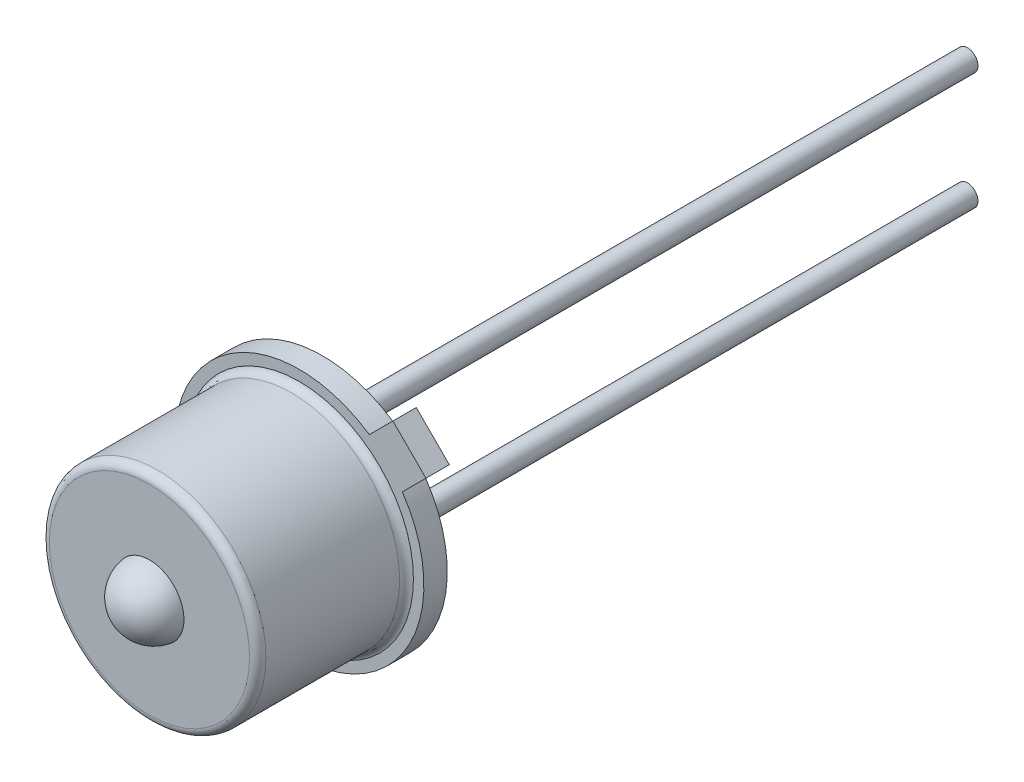
ISO-10303-21;
HEADER;
FILE_DESCRIPTION(('STEP AP214'),'2;1');
FILE_NAME('part.step','',(''),(''),'','','');
FILE_SCHEMA(('AUTOMOTIVE_DESIGN { 1 0 10303 214 1 1 1 1 }'));
ENDSEC;
DATA;
#1=APPLICATION_CONTEXT('core data for automotive mechanical design processes');
#2=APPLICATION_PROTOCOL_DEFINITION('international standard','automotive_design',2000,#1);
#3=PRODUCT_CONTEXT('',#1,'mechanical');
#4=PRODUCT('Part','Part','',(#3));
#5=PRODUCT_RELATED_PRODUCT_CATEGORY('part','',(#4));
#6=PRODUCT_DEFINITION_FORMATION('','',#4);
#7=PRODUCT_DEFINITION_CONTEXT('part definition',#1,'design');
#8=PRODUCT_DEFINITION('design','',#6,#7);
#9=PRODUCT_DEFINITION_SHAPE('','',#8);
#10=(LENGTH_UNIT() NAMED_UNIT(*) SI_UNIT(.MILLI.,.METRE.));
#11=(NAMED_UNIT(*) PLANE_ANGLE_UNIT() SI_UNIT($,.RADIAN.));
#12=(NAMED_UNIT(*) SI_UNIT($,.STERADIAN.) SOLID_ANGLE_UNIT());
#13=UNCERTAINTY_MEASURE_WITH_UNIT(LENGTH_MEASURE(1.E-05),#10,'distance_accuracy_value','');
#14=(GEOMETRIC_REPRESENTATION_CONTEXT(3) GLOBAL_UNCERTAINTY_ASSIGNED_CONTEXT((#13)) GLOBAL_UNIT_ASSIGNED_CONTEXT((#10,
#11,#12)) REPRESENTATION_CONTEXT('',''));
#15=CARTESIAN_POINT('',(0.,0.,0.));
#16=DIRECTION('',(0.,0.,1.));
#17=DIRECTION('',(1.,0.,0.));
#18=AXIS2_PLACEMENT_3D('',#15,#16,#17);
#19=CARTESIAN_POINT('',(0.,0.,3.66431624357357));
#20=DIRECTION('',(0.,0.,-1.));
#21=DIRECTION('',(-1.,0.,0.));
#22=AXIS2_PLACEMENT_3D('',#19,#20,#21);
#23=SPHERICAL_SURFACE('',#22,0.755283653846153);
#24=CARTESIAN_POINT('',(0.,0.,3.75919989741972));
#25=DIRECTION('',(0.,0.,-1.));
#26=DIRECTION('',(-1.,0.,0.));
#27=AXIS2_PLACEMENT_3D('',#24,#25,#26);
#28=CIRCLE('',#27,0.7493);
#29=CARTESIAN_POINT('',(-0.7493,0.,3.75919989741972));
#30=VERTEX_POINT('',#29);
#31=EDGE_CURVE('E13',#30,#30,#28,.T.);
#32=ORIENTED_EDGE('',*,*,#31,.F.);
#33=EDGE_LOOP('',(#32));
#34=FACE_BOUND('',#33,.T.);
#35=ADVANCED_FACE('F55',(#34),#23,.T.);
#36=CARTESIAN_POINT('',(-0.543868966826498,0.,3.75919989741972));
#37=DIRECTION('',(0.,0.,-1.));
#38=DIRECTION('',(-1.,0.,0.));
#39=AXIS2_PLACEMENT_3D('',#36,#37,#38);
#40=PLANE('',#39);
#41=ORIENTED_EDGE('',*,*,#31,.T.);
#42=EDGE_LOOP('',(#41));
#43=FACE_BOUND('',#42,.T.);
#44=CARTESIAN_POINT('',(0.,0.,3.75919989741972));
#45=DIRECTION('',(0.,0.,-1.));
#46=DIRECTION('',(-1.,0.,0.));
#47=AXIS2_PLACEMENT_3D('',#44,#45,#46);
#48=CIRCLE('',#47,0.543868966826498);
#49=CARTESIAN_POINT('',(-0.543868966826498,0.,3.75919989741972));
#50=VERTEX_POINT('',#49);
#51=EDGE_CURVE('E61',#50,#50,#48,.T.);
#52=ORIENTED_EDGE('',*,*,#51,.F.);
#53=EDGE_LOOP('',(#52));
#54=FACE_BOUND('',#53,.T.);
#55=ADVANCED_FACE('F69',(#43,#54),#40,.T.);
#56=CARTESIAN_POINT('',(0.,0.,3.66431624357357));
#57=DIRECTION('',(0.,0.,-1.));
#58=DIRECTION('',(1.,0.,0.));
#59=AXIS2_PLACEMENT_3D('',#56,#57,#58);
#60=SPHERICAL_SURFACE('',#59,0.552083653846153);
#61=ORIENTED_EDGE('',*,*,#51,.T.);
#62=EDGE_LOOP('',(#61));
#63=FACE_BOUND('',#62,.T.);
#64=ADVANCED_FACE('F67',(#63),#60,.F.);
#65=CLOSED_SHELL('',(#35,#55,#64));
#66=MANIFOLD_SOLID_BREP('B2',#65);
#67=CARTESIAN_POINT('',(0.,0.,0.));
#68=DIRECTION('',(0.,0.,1.));
#69=DIRECTION('',(1.,0.,0.));
#70=AXIS2_PLACEMENT_3D('',#67,#68,#69);
#71=PLANE('',#70);
#72=CARTESIAN_POINT('',(0.,1.27,0.));
#73=DIRECTION('',(0.,0.,1.));
#74=DIRECTION('',(1.,0.,0.));
#75=AXIS2_PLACEMENT_3D('',#72,#73,#74);
#76=CIRCLE('',#75,0.2286);
#77=CARTESIAN_POINT('',(0.228600000000003,1.27,0.));
#78=VERTEX_POINT('',#77);
#79=EDGE_CURVE('E112',#78,#78,#76,.F.);
#80=ORIENTED_EDGE('',*,*,#79,.F.);
#81=EDGE_LOOP('',(#80));
#82=FACE_BOUND('',#81,.T.);
#83=CARTESIAN_POINT('',(0.,-1.27,0.));
#84=DIRECTION('',(0.,0.,1.));
#85=DIRECTION('',(1.,0.,0.));
#86=AXIS2_PLACEMENT_3D('',#83,#84,#85);
#87=CIRCLE('',#86,0.2286);
#88=CARTESIAN_POINT('',(0.2286,-1.27,0.));
#89=VERTEX_POINT('',#88);
#90=EDGE_CURVE('E187',#89,#89,#87,.F.);
#91=ORIENTED_EDGE('',*,*,#90,.F.);
#92=EDGE_LOOP('',(#91));
#93=FACE_BOUND('',#92,.T.);
#94=DIRECTION('',(0.707106781186548,0.707106781186547,0.));
#95=VECTOR('',#94,1.);
#96=CARTESIAN_POINT('',(2.74964666119792,2.0323397232714,0.));
#97=LINE('',#96,#95);
#98=CARTESIAN_POINT('',(2.23752299455588,1.52021605662936,0.));
#99=VERTEX_POINT('',#98);
#100=CARTESIAN_POINT('',(2.74964666119792,2.0323397232714,0.));
#101=VERTEX_POINT('',#100);
#102=EDGE_CURVE('E171',#99,#101,#97,.T.);
#103=ORIENTED_EDGE('',*,*,#102,.F.);
#104=CARTESIAN_POINT('',(0.,0.,0.));
#105=DIRECTION('',(0.,0.,1.));
#106=DIRECTION('',(1.,0.,0.));
#107=AXIS2_PLACEMENT_3D('',#104,#105,#106);
#108=CIRCLE('',#107,2.7051);
#109=CARTESIAN_POINT('',(1.52021605662936,2.23752299455588,0.));
#110=VERTEX_POINT('',#109);
#111=EDGE_CURVE('E143',#110,#99,#108,.T.);
#112=ORIENTED_EDGE('',*,*,#111,.F.);
#113=DIRECTION('',(-0.707106781186548,-0.707106781186548,0.));
#114=VECTOR('',#113,1.);
#115=CARTESIAN_POINT('',(2.0323397232714,2.74964666119792,0.));
#116=LINE('',#115,#114);
#117=CARTESIAN_POINT('',(2.0323397232714,2.74964666119792,0.));
#118=VERTEX_POINT('',#117);
#119=EDGE_CURVE('E137',#118,#110,#116,.T.);
#120=ORIENTED_EDGE('',*,*,#119,.F.);
#121=DIRECTION('',(-0.707106781186547,0.707106781186547,0.));
#122=VECTOR('',#121,1.);
#123=CARTESIAN_POINT('',(2.74964666119792,2.0323397232714,0.));
#124=LINE('',#123,#122);
#125=EDGE_CURVE('E161',#101,#118,#124,.T.);
#126=ORIENTED_EDGE('',*,*,#125,.F.);
#127=EDGE_LOOP('',(#103,#112,#120,#126));
#128=FACE_BOUND('',#127,.T.);
#129=CARTESIAN_POINT('',(-1.2645505667785,0.,0.));
#130=DIRECTION('',(0.,0.,1.));
#131=DIRECTION('',(1.,0.,0.));
#132=AXIS2_PLACEMENT_3D('',#129,#130,#131);
#133=CIRCLE('',#132,0.5072126);
#134=CARTESIAN_POINT('',(-0.757337966778502,0.,0.));
#135=VERTEX_POINT('',#134);
#136=EDGE_CURVE('E53',#135,#135,#133,.F.);
#137=ORIENTED_EDGE('',*,*,#136,.F.);
#138=EDGE_LOOP('',(#137));
#139=FACE_BOUND('',#138,.T.);
#140=ADVANCED_FACE('F103',(#82,#93,#128,#139),#71,.F.);
#141=CARTESIAN_POINT('',(2.74964666119792,2.0323397232714,0.5072126));
#142=DIRECTION('',(-0.707106781186547,0.707106781186548,0.));
#143=DIRECTION('',(-0.707106781186548,-0.707106781186547,0.));
#144=AXIS2_PLACEMENT_3D('',#141,#142,#143);
#145=PLANE('',#144);
#146=ORIENTED_EDGE('',*,*,#102,.T.);
#147=DIRECTION('',(0.,0.,-1.));
#148=VECTOR('',#147,1.);
#149=CARTESIAN_POINT('',(2.74964666119792,2.0323397232714,0.5072126));
#150=LINE('',#149,#148);
#151=CARTESIAN_POINT('',(2.74964666119792,2.0323397232714,0.5072126));
#152=VERTEX_POINT('',#151);
#153=EDGE_CURVE('E162',#152,#101,#150,.T.);
#154=ORIENTED_EDGE('',*,*,#153,.F.);
#155=DIRECTION('',(0.707106781186548,0.707106781186547,0.));
#156=VECTOR('',#155,1.);
#157=CARTESIAN_POINT('',(2.74964666119792,2.0323397232714,0.5072126));
#158=LINE('',#157,#156);
#159=CARTESIAN_POINT('',(2.23752299455588,1.52021605662936,0.5072126));
#160=VERTEX_POINT('',#159);
#161=EDGE_CURVE('E156',#160,#152,#158,.T.);
#162=ORIENTED_EDGE('',*,*,#161,.F.);
#163=DIRECTION('',(0.,0.,-1.));
#164=VECTOR('',#163,1.);
#165=CARTESIAN_POINT('',(2.23752299455588,1.52021605662936,0.5072126));
#166=LINE('',#165,#164);
#167=EDGE_CURVE('E167',#160,#99,#166,.T.);
#168=ORIENTED_EDGE('',*,*,#167,.T.);
#169=EDGE_LOOP('',(#146,#154,#162,#168));
#170=FACE_BOUND('',#169,.T.);
#171=ADVANCED_FACE('F105',(#170),#145,.F.);
#172=CARTESIAN_POINT('',(2.74964666119792,2.0323397232714,0.5072126));
#173=DIRECTION('',(-0.707106781186548,-0.707106781186548,0.));
#174=DIRECTION('',(0.707106781186548,-0.707106781186548,0.));
#175=AXIS2_PLACEMENT_3D('',#172,#173,#174);
#176=PLANE('',#175);
#177=ORIENTED_EDGE('',*,*,#125,.T.);
#178=DIRECTION('',(0.,0.,-1.));
#179=VECTOR('',#178,1.);
#180=CARTESIAN_POINT('',(2.0323397232714,2.74964666119792,0.5072126));
#181=LINE('',#180,#179);
#182=CARTESIAN_POINT('',(2.0323397232714,2.74964666119792,0.5072126));
#183=VERTEX_POINT('',#182);
#184=EDGE_CURVE('E159',#183,#118,#181,.T.);
#185=ORIENTED_EDGE('',*,*,#184,.F.);
#186=DIRECTION('',(-0.707106781186547,0.707106781186547,0.));
#187=VECTOR('',#186,1.);
#188=CARTESIAN_POINT('',(2.74964666119792,2.0323397232714,0.5072126));
#189=LINE('',#188,#187);
#190=EDGE_CURVE('E151',#152,#183,#189,.T.);
#191=ORIENTED_EDGE('',*,*,#190,.F.);
#192=ORIENTED_EDGE('',*,*,#153,.T.);
#193=EDGE_LOOP('',(#177,#185,#191,#192));
#194=FACE_BOUND('',#193,.T.);
#195=ADVANCED_FACE('F160',(#194),#176,.F.);
#196=CARTESIAN_POINT('',(2.0323397232714,2.74964666119792,0.5072126));
#197=DIRECTION('',(0.707106781186548,-0.707106781186548,0.));
#198=DIRECTION('',(0.707106781186548,0.707106781186548,0.));
#199=AXIS2_PLACEMENT_3D('',#196,#197,#198);
#200=PLANE('',#199);
#201=ORIENTED_EDGE('',*,*,#119,.T.);
#202=DIRECTION('',(0.,0.,-1.));
#203=VECTOR('',#202,1.);
#204=CARTESIAN_POINT('',(1.52021605662936,2.23752299455588,0.5072126));
#205=LINE('',#204,#203);
#206=CARTESIAN_POINT('',(1.52021605662936,2.23752299455588,0.5072126));
#207=VERTEX_POINT('',#206);
#208=EDGE_CURVE('E163',#207,#110,#205,.T.);
#209=ORIENTED_EDGE('',*,*,#208,.F.);
#210=DIRECTION('',(-0.707106781186548,-0.707106781186548,0.));
#211=VECTOR('',#210,1.);
#212=CARTESIAN_POINT('',(2.0323397232714,2.74964666119792,0.5072126));
#213=LINE('',#212,#211);
#214=EDGE_CURVE('E154',#183,#207,#213,.T.);
#215=ORIENTED_EDGE('',*,*,#214,.F.);
#216=ORIENTED_EDGE('',*,*,#184,.T.);
#217=EDGE_LOOP('',(#201,#209,#215,#216));
#218=FACE_BOUND('',#217,.T.);
#219=ADVANCED_FACE('F165',(#218),#200,.F.);
#220=CARTESIAN_POINT('',(0.,0.,0.5072126));
#221=DIRECTION('',(0.,0.,-1.));
#222=DIRECTION('',(-1.,0.,0.));
#223=AXIS2_PLACEMENT_3D('',#220,#221,#222);
#224=CYLINDRICAL_SURFACE('',#223,2.7051);
#225=ORIENTED_EDGE('',*,*,#111,.T.);
#226=ORIENTED_EDGE('',*,*,#167,.F.);
#227=CARTESIAN_POINT('',(0.,0.,0.5072126));
#228=DIRECTION('',(0.,0.,1.));
#229=DIRECTION('',(1.,0.,0.));
#230=AXIS2_PLACEMENT_3D('',#227,#228,#229);
#231=CIRCLE('',#230,2.7051);
#232=EDGE_CURVE('E120',#207,#160,#231,.T.);
#233=ORIENTED_EDGE('',*,*,#232,.F.);
#234=ORIENTED_EDGE('',*,*,#208,.T.);
#235=EDGE_LOOP('',(#225,#226,#233,#234));
#236=FACE_BOUND('',#235,.T.);
#237=ADVANCED_FACE('F241',(#236),#224,.T.);
#238=CARTESIAN_POINT('',(0.,0.,0.5072126));
#239=DIRECTION('',(0.,0.,1.));
#240=DIRECTION('',(1.,0.,0.));
#241=AXIS2_PLACEMENT_3D('',#238,#239,#240);
#242=PLANE('',#241);
#243=CARTESIAN_POINT('',(0.,0.,0.5072126));
#244=DIRECTION('',(0.,0.,-1.));
#245=DIRECTION('',(-1.,0.,0.));
#246=AXIS2_PLACEMENT_3D('',#243,#244,#245);
#247=CIRCLE('',#246,2.47764353480867);
#248=CARTESIAN_POINT('',(-2.47764353480867,0.,0.5072126));
#249=VERTEX_POINT('',#248);
#250=EDGE_CURVE('E181',#249,#249,#247,.F.);
#251=ORIENTED_EDGE('',*,*,#250,.F.);
#252=EDGE_LOOP('',(#251));
#253=FACE_BOUND('',#252,.T.);
#254=ORIENTED_EDGE('',*,*,#161,.T.);
#255=ORIENTED_EDGE('',*,*,#190,.T.);
#256=ORIENTED_EDGE('',*,*,#214,.T.);
#257=ORIENTED_EDGE('',*,*,#232,.T.);
#258=EDGE_LOOP('',(#254,#255,#256,#257));
#259=FACE_BOUND('',#258,.T.);
#260=ADVANCED_FACE('F152',(#253,#259),#242,.T.);
#261=CARTESIAN_POINT('',(0.,0.,0.5072126));
#262=DIRECTION('',(0.,0.,-1.));
#263=DIRECTION('',(-1.,0.,0.));
#264=AXIS2_PLACEMENT_3D('',#261,#262,#263);
#265=CYLINDRICAL_SURFACE('',#264,2.1971);
#266=CARTESIAN_POINT('',(0.,0.,0.5072126));
#267=DIRECTION('',(0.,0.,1.));
#268=DIRECTION('',(1.,0.,0.));
#269=AXIS2_PLACEMENT_3D('',#266,#267,#268);
#270=CIRCLE('',#269,2.1971);
#271=CARTESIAN_POINT('',(2.1971,0.,0.5072126));
#272=VERTEX_POINT('',#271);
#273=EDGE_CURVE('E184',#272,#272,#270,.F.);
#274=ORIENTED_EDGE('',*,*,#273,.T.);
#275=EDGE_LOOP('',(#274));
#276=FACE_BOUND('',#275,.T.);
#277=CARTESIAN_POINT('',(0.,0.,3.60679989741972));
#278=DIRECTION('',(0.,0.,-1.));
#279=DIRECTION('',(-1.,0.,0.));
#280=AXIS2_PLACEMENT_3D('',#277,#278,#279);
#281=CIRCLE('',#280,2.1971);
#282=CARTESIAN_POINT('',(-2.1971,0.,3.60679989741972));
#283=VERTEX_POINT('',#282);
#284=EDGE_CURVE('E174',#283,#283,#281,.T.);
#285=ORIENTED_EDGE('',*,*,#284,.F.);
#286=EDGE_LOOP('',(#285));
#287=FACE_BOUND('',#286,.T.);
#288=ADVANCED_FACE('F231',(#276,#287),#265,.F.);
#289=CARTESIAN_POINT('',(0.,0.7493,3.60679989741972));
#290=DIRECTION('',(0.,0.,-1.));
#291=DIRECTION('',(-1.,0.,0.));
#292=AXIS2_PLACEMENT_3D('',#289,#290,#291);
#293=PLANE('',#292);
#294=ORIENTED_EDGE('',*,*,#284,.T.);
#295=EDGE_LOOP('',(#294));
#296=FACE_BOUND('',#295,.T.);
#297=CARTESIAN_POINT('',(0.,0.,3.60679989741972));
#298=DIRECTION('',(0.,0.,-1.));
#299=DIRECTION('',(-1.,0.,0.));
#300=AXIS2_PLACEMENT_3D('',#297,#298,#299);
#301=CIRCLE('',#300,0.7493);
#302=CARTESIAN_POINT('',(-0.7493,0.,3.60679989741972));
#303=VERTEX_POINT('',#302);
#304=EDGE_CURVE('E222',#303,#303,#301,.T.);
#305=ORIENTED_EDGE('',*,*,#304,.F.);
#306=EDGE_LOOP('',(#305));
#307=FACE_BOUND('',#306,.T.);
#308=ADVANCED_FACE('F228',(#296,#307),#293,.T.);
#309=CARTESIAN_POINT('',(0.,0.,0.5072126));
#310=DIRECTION('',(0.,0.,-1.));
#311=DIRECTION('',(-1.,0.,0.));
#312=AXIS2_PLACEMENT_3D('',#309,#310,#311);
#313=CYLINDRICAL_SURFACE('',#312,0.7493);
#314=ORIENTED_EDGE('',*,*,#304,.T.);
#315=EDGE_LOOP('',(#314));
#316=FACE_BOUND('',#315,.T.);
#317=CARTESIAN_POINT('',(0.,0.,3.75919989741972));
#318=DIRECTION('',(0.,0.,-1.));
#319=DIRECTION('',(-1.,0.,0.));
#320=AXIS2_PLACEMENT_3D('',#317,#318,#319);
#321=CIRCLE('',#320,0.7493);
#322=CARTESIAN_POINT('',(-0.7493,0.,3.75919989741972));
#323=VERTEX_POINT('',#322);
#324=EDGE_CURVE('E219',#323,#323,#321,.T.);
#325=ORIENTED_EDGE('',*,*,#324,.F.);
#326=EDGE_LOOP('',(#325));
#327=FACE_BOUND('',#326,.T.);
#328=ADVANCED_FACE('F239',(#316,#327),#313,.F.);
#329=CARTESIAN_POINT('',(0.,0.7493,3.75919989741972));
#330=DIRECTION('',(0.,0.,1.));
#331=DIRECTION('',(1.,0.,0.));
#332=AXIS2_PLACEMENT_3D('',#329,#330,#331);
#333=PLANE('',#332);
#334=ORIENTED_EDGE('',*,*,#324,.T.);
#335=EDGE_LOOP('',(#334));
#336=FACE_BOUND('',#335,.T.);
#337=CARTESIAN_POINT('',(0.,0.,3.75919989741972));
#338=DIRECTION('',(0.,0.,-1.));
#339=DIRECTION('',(-1.,0.,0.));
#340=AXIS2_PLACEMENT_3D('',#337,#338,#339);
#341=CIRCLE('',#340,2.1717);
#342=CARTESIAN_POINT('',(-2.1717,0.,3.75919989741972));
#343=VERTEX_POINT('',#342);
#344=EDGE_CURVE('E216',#343,#343,#341,.T.);
#345=ORIENTED_EDGE('',*,*,#344,.F.);
#346=EDGE_LOOP('',(#345));
#347=FACE_BOUND('',#346,.T.);
#348=ADVANCED_FACE('F298',(#336,#347),#333,.T.);
#349=CARTESIAN_POINT('',(0.,0.,3.58139989741972));
#350=DIRECTION('',(0.,0.,-1.));
#351=DIRECTION('',(-1.,0.,0.));
#352=AXIS2_PLACEMENT_3D('',#349,#350,#351);
#353=TOROIDAL_SURFACE('',#352,2.1717,0.1778);
#354=ORIENTED_EDGE('',*,*,#344,.T.);
#355=EDGE_LOOP('',(#354));
#356=FACE_BOUND('',#355,.T.);
#357=CARTESIAN_POINT('',(0.,0.,3.58139989741972));
#358=DIRECTION('',(0.,0.,-1.));
#359=DIRECTION('',(-1.,0.,0.));
#360=AXIS2_PLACEMENT_3D('',#357,#358,#359);
#361=CIRCLE('',#360,2.3495);
#362=CARTESIAN_POINT('',(-2.3495,0.,3.58139989741972));
#363=VERTEX_POINT('',#362);
#364=EDGE_CURVE('E213',#363,#363,#361,.T.);
#365=ORIENTED_EDGE('',*,*,#364,.F.);
#366=EDGE_LOOP('',(#365));
#367=FACE_BOUND('',#366,.T.);
#368=ADVANCED_FACE('F309',(#356,#367),#353,.T.);
#369=CARTESIAN_POINT('',(0.,0.,0.5072126));
#370=DIRECTION('',(0.,0.,-1.));
#371=DIRECTION('',(-1.,0.,0.));
#372=AXIS2_PLACEMENT_3D('',#369,#370,#371);
#373=CYLINDRICAL_SURFACE('',#372,2.3495);
#374=ORIENTED_EDGE('',*,*,#364,.T.);
#375=EDGE_LOOP('',(#374));
#376=FACE_BOUND('',#375,.T.);
#377=CARTESIAN_POINT('',(0.,0.,0.677937745964801));
#378=DIRECTION('',(0.,0.,-1.));
#379=DIRECTION('',(-1.,0.,0.));
#380=AXIS2_PLACEMENT_3D('',#377,#378,#379);
#381=CIRCLE('',#380,2.3495);
#382=CARTESIAN_POINT('',(-2.3495,0.,0.677937745964801));
#383=VERTEX_POINT('',#382);
#384=EDGE_CURVE('E210',#383,#383,#381,.T.);
#385=ORIENTED_EDGE('',*,*,#384,.F.);
#386=EDGE_LOOP('',(#385));
#387=FACE_BOUND('',#386,.T.);
#388=ADVANCED_FACE('F321',(#376,#387),#373,.T.);
#389=CARTESIAN_POINT('',(0.,0.,0.677937745964801));
#390=DIRECTION('',(0.,0.,-1.));
#391=DIRECTION('',(-1.,0.,0.));
#392=AXIS2_PLACEMENT_3D('',#389,#390,#391);
#393=TOROIDAL_SURFACE('',#392,2.5273,0.1778);
#394=ORIENTED_EDGE('',*,*,#384,.T.);
#395=EDGE_LOOP('',(#394));
#396=FACE_BOUND('',#395,.T.);
#397=ORIENTED_EDGE('',*,*,#250,.T.);
#398=EDGE_LOOP('',(#397));
#399=FACE_BOUND('',#398,.T.);
#400=ADVANCED_FACE('F332',(#396,#399),#393,.F.);
#401=ORIENTED_EDGE('',*,*,#273,.F.);
#402=EDGE_LOOP('',(#401));
#403=FACE_BOUND('',#402,.T.);
#404=ADVANCED_FACE('F244',(#403),#242,.T.);
#405=CARTESIAN_POINT('',(0.,-1.27,-13.9954));
#406=DIRECTION('',(0.,0.,1.));
#407=DIRECTION('',(1.,0.,0.));
#408=AXIS2_PLACEMENT_3D('',#405,#406,#407);
#409=CYLINDRICAL_SURFACE('',#408,0.2286);
#410=CARTESIAN_POINT('',(0.,-1.27,-13.9954));
#411=DIRECTION('',(0.,0.,-1.));
#412=DIRECTION('',(-1.,0.,0.));
#413=AXIS2_PLACEMENT_3D('',#410,#411,#412);
#414=CIRCLE('',#413,0.2286);
#415=CARTESIAN_POINT('',(-0.2286,-1.27,-13.9954));
#416=VERTEX_POINT('',#415);
#417=EDGE_CURVE('E207',#416,#416,#414,.T.);
#418=ORIENTED_EDGE('',*,*,#417,.F.);
#419=EDGE_LOOP('',(#418));
#420=FACE_BOUND('',#419,.T.);
#421=ORIENTED_EDGE('',*,*,#90,.T.);
#422=EDGE_LOOP('',(#421));
#423=FACE_BOUND('',#422,.T.);
#424=ADVANCED_FACE('F352',(#420,#423),#409,.T.);
#425=CARTESIAN_POINT('',(0.,-1.27,-13.9954));
#426=DIRECTION('',(0.,0.,-1.));
#427=DIRECTION('',(-1.,0.,0.));
#428=AXIS2_PLACEMENT_3D('',#425,#426,#427);
#429=PLANE('',#428);
#430=ORIENTED_EDGE('',*,*,#417,.T.);
#431=EDGE_LOOP('',(#430));
#432=FACE_BOUND('',#431,.T.);
#433=ADVANCED_FACE('F360',(#432),#429,.T.);
#434=CARTESIAN_POINT('',(0.,1.27,-13.9954));
#435=DIRECTION('',(0.,0.,1.));
#436=DIRECTION('',(1.,0.,0.));
#437=AXIS2_PLACEMENT_3D('',#434,#435,#436);
#438=CYLINDRICAL_SURFACE('',#437,0.2286);
#439=CARTESIAN_POINT('',(0.,1.27,-13.9954));
#440=DIRECTION('',(0.,0.,-1.));
#441=DIRECTION('',(1.,0.,0.));
#442=AXIS2_PLACEMENT_3D('',#439,#440,#441);
#443=CIRCLE('',#442,0.2286);
#444=CARTESIAN_POINT('',(0.228600000000003,1.27,-13.9954));
#445=VERTEX_POINT('',#444);
#446=EDGE_CURVE('E193',#445,#445,#443,.T.);
#447=ORIENTED_EDGE('',*,*,#446,.F.);
#448=EDGE_LOOP('',(#447));
#449=FACE_BOUND('',#448,.T.);
#450=ORIENTED_EDGE('',*,*,#79,.T.);
#451=EDGE_LOOP('',(#450));
#452=FACE_BOUND('',#451,.T.);
#453=ADVANCED_FACE('F371',(#449,#452),#438,.T.);
#454=CARTESIAN_POINT('',(0.,1.27,-13.9954));
#455=DIRECTION('',(0.,0.,1.));
#456=DIRECTION('',(1.,0.,0.));
#457=AXIS2_PLACEMENT_3D('',#454,#455,#456);
#458=PLANE('',#457);
#459=ORIENTED_EDGE('',*,*,#446,.T.);
#460=EDGE_LOOP('',(#459));
#461=FACE_BOUND('',#460,.T.);
#462=ADVANCED_FACE('F397',(#461),#458,.F.);
#463=CARTESIAN_POINT('',(-1.2645505667785,0.,-0.3381502));
#464=DIRECTION('',(0.,0.,-1.));
#465=DIRECTION('',(-1.,0.,0.));
#466=AXIS2_PLACEMENT_3D('',#463,#464,#465);
#467=PLANE('',#466);
#468=CARTESIAN_POINT('',(-1.2645505667785,0.,-0.3381502));
#469=DIRECTION('',(0.,0.,-1.));
#470=DIRECTION('',(-1.,0.,0.));
#471=AXIS2_PLACEMENT_3D('',#468,#469,#470);
#472=CIRCLE('',#471,0.5072126);
#473=CARTESIAN_POINT('',(-1.7717631667785,0.,-0.3381502));
#474=VERTEX_POINT('',#473);
#475=EDGE_CURVE('E194',#474,#474,#472,.T.);
#476=ORIENTED_EDGE('',*,*,#475,.T.);
#477=EDGE_LOOP('',(#476));
#478=FACE_BOUND('',#477,.T.);
#479=CARTESIAN_POINT('',(-1.27,0.,-0.3381502));
#480=DIRECTION('',(0.,0.,-1.));
#481=DIRECTION('',(-1.,0.,0.));
#482=AXIS2_PLACEMENT_3D('',#479,#480,#481);
#483=CIRCLE('',#482,0.2286);
#484=CARTESIAN_POINT('',(-1.4986,0.,-0.3381502));
#485=VERTEX_POINT('',#484);
#486=EDGE_CURVE('E191',#485,#485,#483,.T.);
#487=ORIENTED_EDGE('',*,*,#486,.F.);
#488=EDGE_LOOP('',(#487));
#489=FACE_BOUND('',#488,.T.);
#490=ADVANCED_FACE('F408',(#478,#489),#467,.T.);
#491=CARTESIAN_POINT('',(-1.2645505667785,0.,-0.3381502));
#492=DIRECTION('',(0.,0.,1.));
#493=DIRECTION('',(1.,0.,0.));
#494=AXIS2_PLACEMENT_3D('',#491,#492,#493);
#495=CYLINDRICAL_SURFACE('',#494,0.5072126);
#496=ORIENTED_EDGE('',*,*,#475,.F.);
#497=EDGE_LOOP('',(#496));
#498=FACE_BOUND('',#497,.T.);
#499=ORIENTED_EDGE('',*,*,#136,.T.);
#500=EDGE_LOOP('',(#499));
#501=FACE_BOUND('',#500,.T.);
#502=ADVANCED_FACE('F385',(#498,#501),#495,.T.);
#503=CARTESIAN_POINT('',(-1.27,0.,-13.9954));
#504=DIRECTION('',(0.,0.,1.));
#505=DIRECTION('',(1.,0.,0.));
#506=AXIS2_PLACEMENT_3D('',#503,#504,#505);
#507=PLANE('',#506);
#508=CARTESIAN_POINT('',(-1.27,0.,-13.9954));
#509=DIRECTION('',(0.,0.,-1.));
#510=DIRECTION('',(1.,0.,0.));
#511=AXIS2_PLACEMENT_3D('',#508,#509,#510);
#512=CIRCLE('',#511,0.2286);
#513=CARTESIAN_POINT('',(-1.0414,0.,-13.9954));
#514=VERTEX_POINT('',#513);
#515=EDGE_CURVE('E198',#514,#514,#512,.T.);
#516=ORIENTED_EDGE('',*,*,#515,.T.);
#517=EDGE_LOOP('',(#516));
#518=FACE_BOUND('',#517,.T.);
#519=ADVANCED_FACE('F379',(#518),#507,.F.);
#520=CARTESIAN_POINT('',(-1.27,0.,-13.9954));
#521=DIRECTION('',(0.,0.,1.));
#522=DIRECTION('',(1.,0.,0.));
#523=AXIS2_PLACEMENT_3D('',#520,#521,#522);
#524=CYLINDRICAL_SURFACE('',#523,0.2286);
#525=ORIENTED_EDGE('',*,*,#486,.T.);
#526=EDGE_LOOP('',(#525));
#527=FACE_BOUND('',#526,.T.);
#528=ORIENTED_EDGE('',*,*,#515,.F.);
#529=EDGE_LOOP('',(#528));
#530=FACE_BOUND('',#529,.T.);
#531=ADVANCED_FACE('F384',(#527,#530),#524,.T.);
#532=CLOSED_SHELL('',(#140,#171,#195,#219,#237,#260,#288,#308,#328,#348,#368,#388,#400,#404,
#424,#433,#453,#462,#490,#502,#519,#531));
#533=MANIFOLD_SOLID_BREP('B8',#532);
#534=ADVANCED_BREP_SHAPE_REPRESENTATION('',(#18,#66,#533),#14);
#535=SHAPE_DEFINITION_REPRESENTATION(#9,#534);
ENDSEC;
END-ISO-10303-21;
